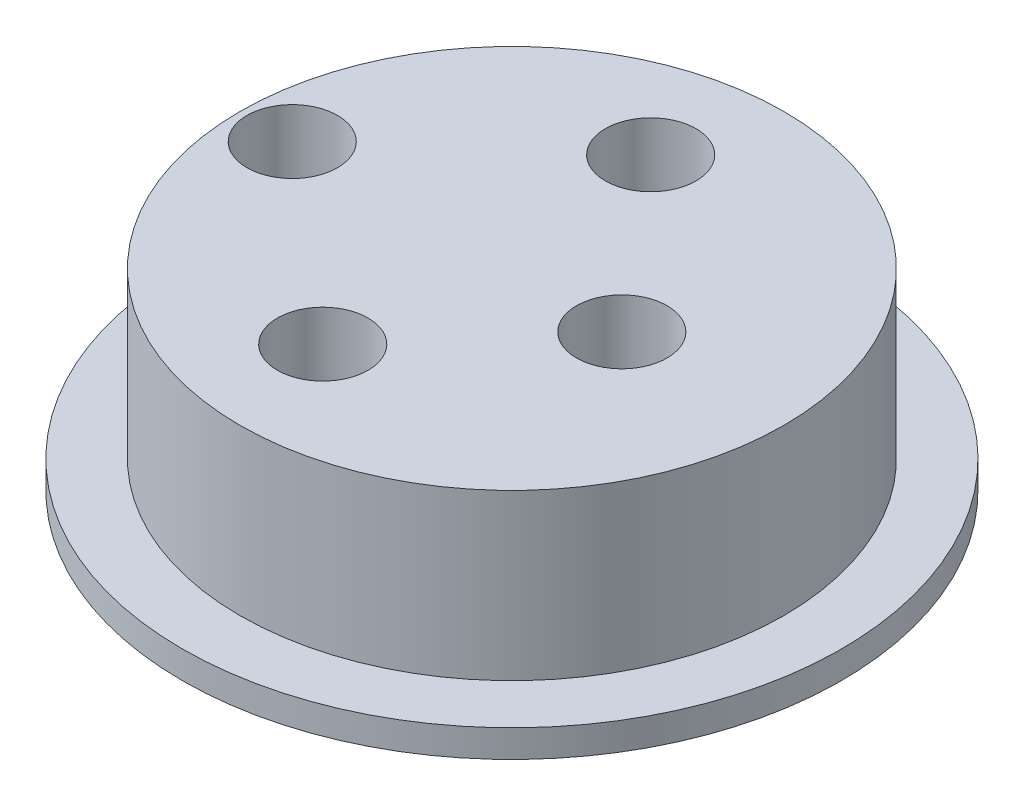
ISO-10303-21;
HEADER;
FILE_DESCRIPTION(('STEP AP214'),'2;1');
FILE_NAME('part.step','',(''),(''),'','','');
FILE_SCHEMA(('AUTOMOTIVE_DESIGN { 1 0 10303 214 1 1 1 1 }'));
ENDSEC;
DATA;
#1=APPLICATION_CONTEXT('core data for automotive mechanical design processes');
#2=APPLICATION_PROTOCOL_DEFINITION('international standard','automotive_design',2000,#1);
#3=PRODUCT_CONTEXT('',#1,'mechanical');
#4=PRODUCT('Part','Part','',(#3));
#5=PRODUCT_RELATED_PRODUCT_CATEGORY('part','',(#4));
#6=PRODUCT_DEFINITION_FORMATION('','',#4);
#7=PRODUCT_DEFINITION_CONTEXT('part definition',#1,'design');
#8=PRODUCT_DEFINITION('design','',#6,#7);
#9=PRODUCT_DEFINITION_SHAPE('','',#8);
#10=(LENGTH_UNIT() NAMED_UNIT(*) SI_UNIT(.MILLI.,.METRE.));
#11=(NAMED_UNIT(*) PLANE_ANGLE_UNIT() SI_UNIT($,.RADIAN.));
#12=(NAMED_UNIT(*) SI_UNIT($,.STERADIAN.) SOLID_ANGLE_UNIT());
#13=UNCERTAINTY_MEASURE_WITH_UNIT(LENGTH_MEASURE(1.E-05),#10,'distance_accuracy_value','');
#14=(GEOMETRIC_REPRESENTATION_CONTEXT(3) GLOBAL_UNCERTAINTY_ASSIGNED_CONTEXT((#13)) GLOBAL_UNIT_ASSIGNED_CONTEXT((#10,
#11,#12)) REPRESENTATION_CONTEXT('',''));
#15=CARTESIAN_POINT('',(0.,0.,0.));
#16=DIRECTION('',(0.,0.,1.));
#17=DIRECTION('',(1.,0.,0.));
#18=AXIS2_PLACEMENT_3D('',#15,#16,#17);
#19=CARTESIAN_POINT('',(1.97506274792874,7.,-0.154777046724663));
#20=DIRECTION('',(0.,-1.,0.));
#21=DIRECTION('',(0.,0.,-1.));
#22=AXIS2_PLACEMENT_3D('',#19,#20,#21);
#23=CYLINDRICAL_SURFACE('',#22,9.9);
#24=CARTESIAN_POINT('',(1.97506274792874,1.,-0.154777046724663));
#25=DIRECTION('',(0.,1.,0.));
#26=DIRECTION('',(0.,0.,1.));
#27=AXIS2_PLACEMENT_3D('',#24,#25,#26);
#28=CIRCLE('',#27,9.9);
#29=CARTESIAN_POINT('',(1.97506274792874,1.,9.74522295327534));
#30=VERTEX_POINT('',#29);
#31=EDGE_CURVE('E45',#30,#30,#28,.T.);
#32=ORIENTED_EDGE('',*,*,#31,.T.);
#33=EDGE_LOOP('',(#32));
#34=FACE_BOUND('',#33,.T.);
#35=CARTESIAN_POINT('',(1.97506274792874,7.,-0.154777046724663));
#36=DIRECTION('',(0.,1.,0.));
#37=DIRECTION('',(0.,0.,1.));
#38=AXIS2_PLACEMENT_3D('',#35,#36,#37);
#39=CIRCLE('',#38,9.9);
#40=CARTESIAN_POINT('',(1.97506274792874,7.,9.74522295327534));
#41=VERTEX_POINT('',#40);
#42=EDGE_CURVE('E10',#41,#41,#39,.T.);
#43=ORIENTED_EDGE('',*,*,#42,.F.);
#44=EDGE_LOOP('',(#43));
#45=FACE_BOUND('',#44,.T.);
#46=ADVANCED_FACE('F39',(#34,#45),#23,.T.);
#47=CARTESIAN_POINT('',(1.97506274792874,7.,-0.154777046724663));
#48=DIRECTION('',(0.,1.,0.));
#49=DIRECTION('',(0.,0.,1.));
#50=AXIS2_PLACEMENT_3D('',#47,#48,#49);
#51=PLANE('',#50);
#52=CARTESIAN_POINT('',(-6.02493725207126,7.,-0.154777046724663));
#53=DIRECTION('',(0.,1.,0.));
#54=DIRECTION('',(0.,0.,1.));
#55=AXIS2_PLACEMENT_3D('',#52,#53,#54);
#56=CIRCLE('',#55,1.65);
#57=CARTESIAN_POINT('',(-6.02493725207126,7.,1.49522295327534));
#58=VERTEX_POINT('',#57);
#59=EDGE_CURVE('E53',#58,#58,#56,.F.);
#60=ORIENTED_EDGE('',*,*,#59,.T.);
#61=EDGE_LOOP('',(#60));
#62=FACE_BOUND('',#61,.T.);
#63=CARTESIAN_POINT('',(0.917956722612008,7.,-6.26426455344228));
#64=DIRECTION('',(0.,1.,0.));
#65=DIRECTION('',(0.,0.,1.));
#66=AXIS2_PLACEMENT_3D('',#63,#64,#65);
#67=CIRCLE('',#66,1.65);
#68=CARTESIAN_POINT('',(0.917956722612008,7.,-4.61426455344228));
#69=VERTEX_POINT('',#68);
#70=EDGE_CURVE('E56',#69,#69,#67,.F.);
#71=ORIENTED_EDGE('',*,*,#70,.T.);
#72=EDGE_LOOP('',(#71));
#73=FACE_BOUND('',#72,.T.);
#74=CARTESIAN_POINT('',(0.917956722612008,7.,5.67777713426732));
#75=DIRECTION('',(0.,1.,0.));
#76=DIRECTION('',(0.,0.,1.));
#77=AXIS2_PLACEMENT_3D('',#74,#75,#76);
#78=CIRCLE('',#77,1.65);
#79=CARTESIAN_POINT('',(0.917956722612008,7.,7.32777713426732));
#80=VERTEX_POINT('',#79);
#81=EDGE_CURVE('E61',#80,#80,#78,.F.);
#82=ORIENTED_EDGE('',*,*,#81,.T.);
#83=EDGE_LOOP('',(#82));
#84=FACE_BOUND('',#83,.T.);
#85=CARTESIAN_POINT('',(5.97506274792874,7.,-0.154777046724663));
#86=DIRECTION('',(0.,1.,0.));
#87=DIRECTION('',(0.,0.,1.));
#88=AXIS2_PLACEMENT_3D('',#85,#86,#87);
#89=CIRCLE('',#88,1.65);
#90=CARTESIAN_POINT('',(5.97506274792874,7.,1.49522295327534));
#91=VERTEX_POINT('',#90);
#92=EDGE_CURVE('E62',#91,#91,#89,.F.);
#93=ORIENTED_EDGE('',*,*,#92,.T.);
#94=EDGE_LOOP('',(#93));
#95=FACE_BOUND('',#94,.T.);
#96=ORIENTED_EDGE('',*,*,#42,.T.);
#97=EDGE_LOOP('',(#96));
#98=FACE_BOUND('',#97,.T.);
#99=ADVANCED_FACE('F100',(#62,#73,#84,#95,#98),#51,.T.);
#100=CARTESIAN_POINT('',(1.97506274792874,1.,-0.154777046724663));
#101=DIRECTION('',(0.,-1.,0.));
#102=DIRECTION('',(0.,0.,-1.));
#103=AXIS2_PLACEMENT_3D('',#100,#101,#102);
#104=CYLINDRICAL_SURFACE('',#103,12.);
#105=CARTESIAN_POINT('',(1.97506274792874,1.,-0.154777046724663));
#106=DIRECTION('',(0.,1.,0.));
#107=DIRECTION('',(0.,0.,1.));
#108=AXIS2_PLACEMENT_3D('',#105,#106,#107);
#109=CIRCLE('',#108,12.);
#110=CARTESIAN_POINT('',(1.97506274792874,1.,11.8452229532753));
#111=VERTEX_POINT('',#110);
#112=EDGE_CURVE('E47',#111,#111,#109,.T.);
#113=ORIENTED_EDGE('',*,*,#112,.F.);
#114=EDGE_LOOP('',(#113));
#115=FACE_BOUND('',#114,.T.);
#116=CARTESIAN_POINT('',(1.97506274792874,0.,-0.154777046724663));
#117=DIRECTION('',(0.,1.,0.));
#118=DIRECTION('',(0.,0.,1.));
#119=AXIS2_PLACEMENT_3D('',#116,#117,#118);
#120=CIRCLE('',#119,12.);
#121=CARTESIAN_POINT('',(1.97506274792874,0.,11.8452229532753));
#122=VERTEX_POINT('',#121);
#123=EDGE_CURVE('E51',#122,#122,#120,.T.);
#124=ORIENTED_EDGE('',*,*,#123,.T.);
#125=EDGE_LOOP('',(#124));
#126=FACE_BOUND('',#125,.T.);
#127=ADVANCED_FACE('F103',(#115,#126),#104,.T.);
#128=CARTESIAN_POINT('',(1.97506274792874,1.,-0.154777046724663));
#129=DIRECTION('',(0.,1.,0.));
#130=DIRECTION('',(0.,0.,1.));
#131=AXIS2_PLACEMENT_3D('',#128,#129,#130);
#132=PLANE('',#131);
#133=ORIENTED_EDGE('',*,*,#31,.F.);
#134=EDGE_LOOP('',(#133));
#135=FACE_BOUND('',#134,.T.);
#136=ORIENTED_EDGE('',*,*,#112,.T.);
#137=EDGE_LOOP('',(#136));
#138=FACE_BOUND('',#137,.T.);
#139=ADVANCED_FACE('F108',(#135,#138),#132,.T.);
#140=CARTESIAN_POINT('',(1.97506274792874,0.,-0.154777046724663));
#141=DIRECTION('',(0.,1.,0.));
#142=DIRECTION('',(0.,0.,1.));
#143=AXIS2_PLACEMENT_3D('',#140,#141,#142);
#144=PLANE('',#143);
#145=CARTESIAN_POINT('',(-6.02493725207126,0.,-0.154777046724663));
#146=DIRECTION('',(0.,1.,0.));
#147=DIRECTION('',(0.,0.,1.));
#148=AXIS2_PLACEMENT_3D('',#145,#146,#147);
#149=CIRCLE('',#148,1.65);
#150=CARTESIAN_POINT('',(-6.02493725207126,0.,1.49522295327534));
#151=VERTEX_POINT('',#150);
#152=EDGE_CURVE('E70',#151,#151,#149,.T.);
#153=ORIENTED_EDGE('',*,*,#152,.T.);
#154=EDGE_LOOP('',(#153));
#155=FACE_BOUND('',#154,.T.);
#156=CARTESIAN_POINT('',(0.917956722612008,0.,-6.26426455344228));
#157=DIRECTION('',(0.,1.,0.));
#158=DIRECTION('',(0.,0.,1.));
#159=AXIS2_PLACEMENT_3D('',#156,#157,#158);
#160=CIRCLE('',#159,1.65);
#161=CARTESIAN_POINT('',(0.917956722612008,0.,-4.61426455344228));
#162=VERTEX_POINT('',#161);
#163=EDGE_CURVE('E73',#162,#162,#160,.T.);
#164=ORIENTED_EDGE('',*,*,#163,.T.);
#165=EDGE_LOOP('',(#164));
#166=FACE_BOUND('',#165,.T.);
#167=CARTESIAN_POINT('',(0.917956722612008,0.,5.67777713426732));
#168=DIRECTION('',(0.,1.,0.));
#169=DIRECTION('',(0.,0.,1.));
#170=AXIS2_PLACEMENT_3D('',#167,#168,#169);
#171=CIRCLE('',#170,1.65);
#172=CARTESIAN_POINT('',(0.917956722612008,0.,7.32777713426732));
#173=VERTEX_POINT('',#172);
#174=EDGE_CURVE('E75',#173,#173,#171,.T.);
#175=ORIENTED_EDGE('',*,*,#174,.T.);
#176=EDGE_LOOP('',(#175));
#177=FACE_BOUND('',#176,.T.);
#178=CARTESIAN_POINT('',(5.97506274792874,0.,-0.154777046724663));
#179=DIRECTION('',(0.,1.,0.));
#180=DIRECTION('',(0.,0.,1.));
#181=AXIS2_PLACEMENT_3D('',#178,#179,#180);
#182=CIRCLE('',#181,1.65);
#183=CARTESIAN_POINT('',(5.97506274792874,0.,1.49522295327534));
#184=VERTEX_POINT('',#183);
#185=EDGE_CURVE('E68',#184,#184,#182,.T.);
#186=ORIENTED_EDGE('',*,*,#185,.T.);
#187=EDGE_LOOP('',(#186));
#188=FACE_BOUND('',#187,.T.);
#189=ORIENTED_EDGE('',*,*,#123,.F.);
#190=EDGE_LOOP('',(#189));
#191=FACE_BOUND('',#190,.T.);
#192=ADVANCED_FACE('F84',(#155,#166,#177,#188,#191),#144,.F.);
#193=CARTESIAN_POINT('',(5.97506274792874,31.,-0.154777046724663));
#194=DIRECTION('',(0.,-1.,0.));
#195=DIRECTION('',(0.,0.,-1.));
#196=AXIS2_PLACEMENT_3D('',#193,#194,#195);
#197=CYLINDRICAL_SURFACE('',#196,1.65);
#198=ORIENTED_EDGE('',*,*,#92,.F.);
#199=EDGE_LOOP('',(#198));
#200=FACE_BOUND('',#199,.T.);
#201=ORIENTED_EDGE('',*,*,#185,.F.);
#202=EDGE_LOOP('',(#201));
#203=FACE_BOUND('',#202,.T.);
#204=ADVANCED_FACE('F117',(#200,#203),#197,.F.);
#205=CARTESIAN_POINT('',(0.917956722612008,31.,5.67777713426732));
#206=DIRECTION('',(0.,-1.,0.));
#207=DIRECTION('',(0.,0.,-1.));
#208=AXIS2_PLACEMENT_3D('',#205,#206,#207);
#209=CYLINDRICAL_SURFACE('',#208,1.65);
#210=ORIENTED_EDGE('',*,*,#81,.F.);
#211=EDGE_LOOP('',(#210));
#212=FACE_BOUND('',#211,.T.);
#213=ORIENTED_EDGE('',*,*,#174,.F.);
#214=EDGE_LOOP('',(#213));
#215=FACE_BOUND('',#214,.T.);
#216=ADVANCED_FACE('F95',(#212,#215),#209,.F.);
#217=CARTESIAN_POINT('',(0.917956722612008,31.,-6.26426455344228));
#218=DIRECTION('',(0.,-1.,0.));
#219=DIRECTION('',(0.,0.,-1.));
#220=AXIS2_PLACEMENT_3D('',#217,#218,#219);
#221=CYLINDRICAL_SURFACE('',#220,1.65);
#222=ORIENTED_EDGE('',*,*,#70,.F.);
#223=EDGE_LOOP('',(#222));
#224=FACE_BOUND('',#223,.T.);
#225=ORIENTED_EDGE('',*,*,#163,.F.);
#226=EDGE_LOOP('',(#225));
#227=FACE_BOUND('',#226,.T.);
#228=ADVANCED_FACE('F88',(#224,#227),#221,.F.);
#229=CARTESIAN_POINT('',(-6.02493725207126,31.,-0.154777046724663));
#230=DIRECTION('',(0.,-1.,0.));
#231=DIRECTION('',(0.,0.,-1.));
#232=AXIS2_PLACEMENT_3D('',#229,#230,#231);
#233=CYLINDRICAL_SURFACE('',#232,1.65);
#234=ORIENTED_EDGE('',*,*,#59,.F.);
#235=EDGE_LOOP('',(#234));
#236=FACE_BOUND('',#235,.T.);
#237=ORIENTED_EDGE('',*,*,#152,.F.);
#238=EDGE_LOOP('',(#237));
#239=FACE_BOUND('',#238,.T.);
#240=ADVANCED_FACE('F83',(#236,#239),#233,.F.);
#241=CLOSED_SHELL('',(#46,#99,#127,#139,#192,#204,#216,#228,#240));
#242=MANIFOLD_SOLID_BREP('B2',#241);
#243=ADVANCED_BREP_SHAPE_REPRESENTATION('',(#18,#242),#14);
#244=SHAPE_DEFINITION_REPRESENTATION(#9,#243);
ENDSEC;
END-ISO-10303-21;
